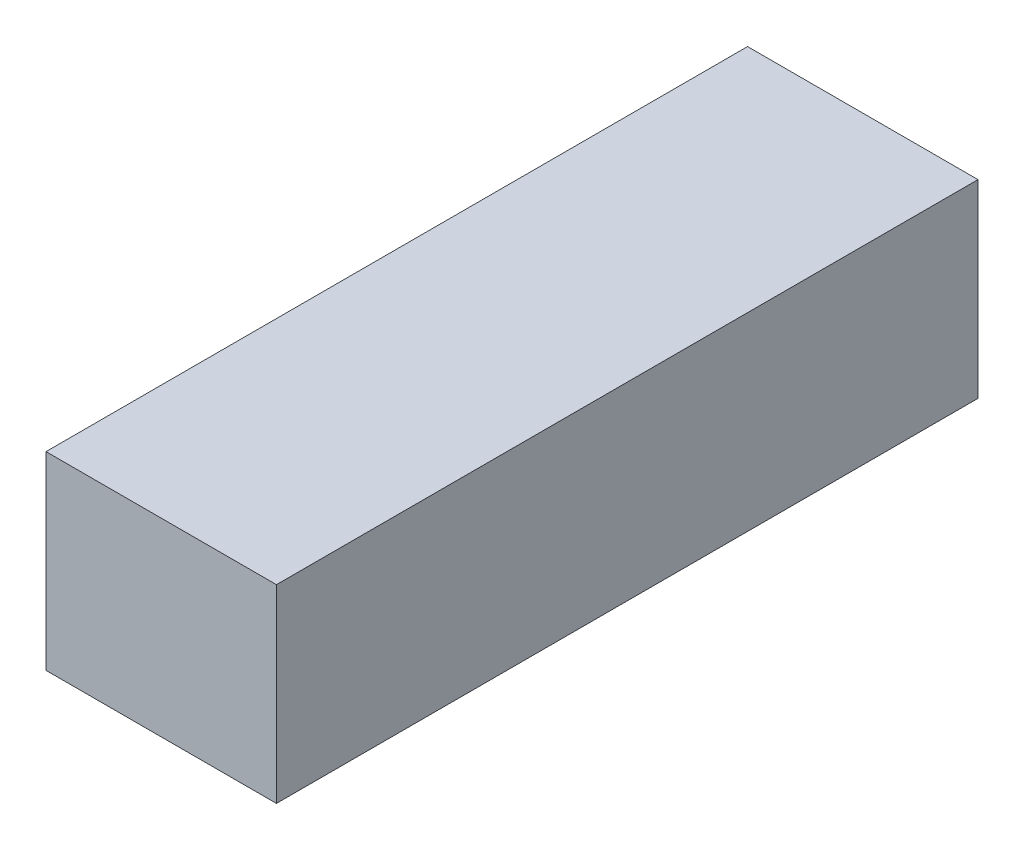
ISO-10303-21;
HEADER;
FILE_DESCRIPTION(('STEP AP214'),'2;1');
FILE_NAME('part.step','',(''),(''),'','','');
FILE_SCHEMA(('AUTOMOTIVE_DESIGN { 1 0 10303 214 1 1 1 1 }'));
ENDSEC;
DATA;
#1=APPLICATION_CONTEXT('core data for automotive mechanical design processes');
#2=APPLICATION_PROTOCOL_DEFINITION('international standard','automotive_design',2000,#1);
#3=PRODUCT_CONTEXT('',#1,'mechanical');
#4=PRODUCT('Part','Part','',(#3));
#5=PRODUCT_RELATED_PRODUCT_CATEGORY('part','',(#4));
#6=PRODUCT_DEFINITION_FORMATION('','',#4);
#7=PRODUCT_DEFINITION_CONTEXT('part definition',#1,'design');
#8=PRODUCT_DEFINITION('design','',#6,#7);
#9=PRODUCT_DEFINITION_SHAPE('','',#8);
#10=(LENGTH_UNIT() NAMED_UNIT(*) SI_UNIT(.MILLI.,.METRE.));
#11=(NAMED_UNIT(*) PLANE_ANGLE_UNIT() SI_UNIT($,.RADIAN.));
#12=(NAMED_UNIT(*) SI_UNIT($,.STERADIAN.) SOLID_ANGLE_UNIT());
#13=UNCERTAINTY_MEASURE_WITH_UNIT(LENGTH_MEASURE(1.E-05),#10,'distance_accuracy_value','');
#14=(GEOMETRIC_REPRESENTATION_CONTEXT(3) GLOBAL_UNCERTAINTY_ASSIGNED_CONTEXT((#13)) GLOBAL_UNIT_ASSIGNED_CONTEXT((#10,
#11,#12)) REPRESENTATION_CONTEXT('',''));
#15=CARTESIAN_POINT('',(0.,0.,0.));
#16=DIRECTION('',(0.,0.,1.));
#17=DIRECTION('',(1.,0.,0.));
#18=AXIS2_PLACEMENT_3D('',#15,#16,#17);
#19=CARTESIAN_POINT('',(22.5,18.5,137.));
#20=DIRECTION('',(-1.,0.,0.));
#21=DIRECTION('',(0.,-1.,0.));
#22=AXIS2_PLACEMENT_3D('',#19,#20,#21);
#23=PLANE('',#22);
#24=DIRECTION('',(0.,1.,0.));
#25=VECTOR('',#24,1.);
#26=CARTESIAN_POINT('',(22.5,18.5,0.));
#27=LINE('',#26,#25);
#28=CARTESIAN_POINT('',(22.5,-18.5,0.));
#29=VERTEX_POINT('',#28);
#30=CARTESIAN_POINT('',(22.5,18.5,0.));
#31=VERTEX_POINT('',#30);
#32=EDGE_CURVE('E107',#29,#31,#27,.T.);
#33=ORIENTED_EDGE('',*,*,#32,.T.);
#34=DIRECTION('',(0.,0.,-1.));
#35=VECTOR('',#34,1.);
#36=CARTESIAN_POINT('',(22.5,18.5,137.));
#37=LINE('',#36,#35);
#38=CARTESIAN_POINT('',(22.5,18.5,137.));
#39=VERTEX_POINT('',#38);
#40=EDGE_CURVE('E11',#39,#31,#37,.T.);
#41=ORIENTED_EDGE('',*,*,#40,.F.);
#42=DIRECTION('',(0.,1.,0.));
#43=VECTOR('',#42,1.);
#44=CARTESIAN_POINT('',(22.5,18.5,137.));
#45=LINE('',#44,#43);
#46=CARTESIAN_POINT('',(22.5,-18.5,137.));
#47=VERTEX_POINT('',#46);
#48=EDGE_CURVE('E91',#47,#39,#45,.T.);
#49=ORIENTED_EDGE('',*,*,#48,.F.);
#50=DIRECTION('',(0.,0.,-1.));
#51=VECTOR('',#50,1.);
#52=CARTESIAN_POINT('',(22.5,-18.5,137.));
#53=LINE('',#52,#51);
#54=EDGE_CURVE('E103',#47,#29,#53,.T.);
#55=ORIENTED_EDGE('',*,*,#54,.T.);
#56=EDGE_LOOP('',(#33,#41,#49,#55));
#57=FACE_BOUND('',#56,.T.);
#58=ADVANCED_FACE('F39',(#57),#23,.F.);
#59=CARTESIAN_POINT('',(-22.5,18.5,137.));
#60=DIRECTION('',(0.,-1.,0.));
#61=DIRECTION('',(0.,0.,-1.));
#62=AXIS2_PLACEMENT_3D('',#59,#60,#61);
#63=PLANE('',#62);
#64=DIRECTION('',(-1.,0.,0.));
#65=VECTOR('',#64,1.);
#66=CARTESIAN_POINT('',(-22.5,18.5,0.));
#67=LINE('',#66,#65);
#68=CARTESIAN_POINT('',(-22.5,18.5,0.));
#69=VERTEX_POINT('',#68);
#70=EDGE_CURVE('E96',#31,#69,#67,.T.);
#71=ORIENTED_EDGE('',*,*,#70,.T.);
#72=DIRECTION('',(0.,0.,-1.));
#73=VECTOR('',#72,1.);
#74=CARTESIAN_POINT('',(-22.5,18.5,137.));
#75=LINE('',#74,#73);
#76=CARTESIAN_POINT('',(-22.5,18.5,137.));
#77=VERTEX_POINT('',#76);
#78=EDGE_CURVE('E48',#77,#69,#75,.T.);
#79=ORIENTED_EDGE('',*,*,#78,.F.);
#80=DIRECTION('',(-1.,0.,0.));
#81=VECTOR('',#80,1.);
#82=CARTESIAN_POINT('',(-22.5,18.5,137.));
#83=LINE('',#82,#81);
#84=EDGE_CURVE('E86',#39,#77,#83,.T.);
#85=ORIENTED_EDGE('',*,*,#84,.F.);
#86=ORIENTED_EDGE('',*,*,#40,.T.);
#87=EDGE_LOOP('',(#71,#79,#85,#86));
#88=FACE_BOUND('',#87,.T.);
#89=ADVANCED_FACE('F95',(#88),#63,.F.);
#90=CARTESIAN_POINT('',(-22.5,18.5,137.));
#91=DIRECTION('',(1.,0.,0.));
#92=DIRECTION('',(0.,1.,0.));
#93=AXIS2_PLACEMENT_3D('',#90,#91,#92);
#94=PLANE('',#93);
#95=DIRECTION('',(0.,-1.,0.));
#96=VECTOR('',#95,1.);
#97=CARTESIAN_POINT('',(-22.5,18.5,0.));
#98=LINE('',#97,#96);
#99=CARTESIAN_POINT('',(-22.5,-18.5,0.));
#100=VERTEX_POINT('',#99);
#101=EDGE_CURVE('E73',#69,#100,#98,.T.);
#102=ORIENTED_EDGE('',*,*,#101,.T.);
#103=DIRECTION('',(0.,0.,-1.));
#104=VECTOR('',#103,1.);
#105=CARTESIAN_POINT('',(-22.5,-18.5,137.));
#106=LINE('',#105,#104);
#107=CARTESIAN_POINT('',(-22.5,-18.5,137.));
#108=VERTEX_POINT('',#107);
#109=EDGE_CURVE('E98',#108,#100,#106,.T.);
#110=ORIENTED_EDGE('',*,*,#109,.F.);
#111=DIRECTION('',(0.,-1.,0.));
#112=VECTOR('',#111,1.);
#113=CARTESIAN_POINT('',(-22.5,18.5,137.));
#114=LINE('',#113,#112);
#115=EDGE_CURVE('E89',#77,#108,#114,.T.);
#116=ORIENTED_EDGE('',*,*,#115,.F.);
#117=ORIENTED_EDGE('',*,*,#78,.T.);
#118=EDGE_LOOP('',(#102,#110,#116,#117));
#119=FACE_BOUND('',#118,.T.);
#120=ADVANCED_FACE('F99',(#119),#94,.F.);
#121=CARTESIAN_POINT('',(-22.5,-18.5,137.));
#122=DIRECTION('',(0.,1.,0.));
#123=DIRECTION('',(0.,0.,1.));
#124=AXIS2_PLACEMENT_3D('',#121,#122,#123);
#125=PLANE('',#124);
#126=DIRECTION('',(1.,0.,0.));
#127=VECTOR('',#126,1.);
#128=CARTESIAN_POINT('',(-22.5,-18.5,0.));
#129=LINE('',#128,#127);
#130=EDGE_CURVE('E79',#100,#29,#129,.T.);
#131=ORIENTED_EDGE('',*,*,#130,.T.);
#132=ORIENTED_EDGE('',*,*,#54,.F.);
#133=DIRECTION('',(1.,0.,0.));
#134=VECTOR('',#133,1.);
#135=CARTESIAN_POINT('',(-22.5,-18.5,137.));
#136=LINE('',#135,#134);
#137=EDGE_CURVE('E56',#108,#47,#136,.T.);
#138=ORIENTED_EDGE('',*,*,#137,.F.);
#139=ORIENTED_EDGE('',*,*,#109,.T.);
#140=EDGE_LOOP('',(#131,#132,#138,#139));
#141=FACE_BOUND('',#140,.T.);
#142=ADVANCED_FACE('F120',(#141),#125,.F.);
#143=CARTESIAN_POINT('',(0.,0.,137.));
#144=DIRECTION('',(0.,0.,1.));
#145=DIRECTION('',(1.,0.,0.));
#146=AXIS2_PLACEMENT_3D('',#143,#144,#145);
#147=PLANE('',#146);
#148=ORIENTED_EDGE('',*,*,#48,.T.);
#149=ORIENTED_EDGE('',*,*,#84,.T.);
#150=ORIENTED_EDGE('',*,*,#115,.T.);
#151=ORIENTED_EDGE('',*,*,#137,.T.);
#152=EDGE_LOOP('',(#148,#149,#150,#151));
#153=FACE_BOUND('',#152,.T.);
#154=ADVANCED_FACE('F87',(#153),#147,.T.);
#155=CARTESIAN_POINT('',(0.,0.,0.));
#156=DIRECTION('',(0.,0.,1.));
#157=DIRECTION('',(1.,0.,0.));
#158=AXIS2_PLACEMENT_3D('',#155,#156,#157);
#159=PLANE('',#158);
#160=ORIENTED_EDGE('',*,*,#32,.F.);
#161=ORIENTED_EDGE('',*,*,#130,.F.);
#162=ORIENTED_EDGE('',*,*,#101,.F.);
#163=ORIENTED_EDGE('',*,*,#70,.F.);
#164=EDGE_LOOP('',(#160,#161,#162,#163));
#165=FACE_BOUND('',#164,.T.);
#166=ADVANCED_FACE('F123',(#165),#159,.F.);
#167=CLOSED_SHELL('',(#58,#89,#120,#142,#154,#166));
#168=MANIFOLD_SOLID_BREP('B2',#167);
#169=ADVANCED_BREP_SHAPE_REPRESENTATION('',(#18,#168),#14);
#170=SHAPE_DEFINITION_REPRESENTATION(#9,#169);
ENDSEC;
END-ISO-10303-21;
